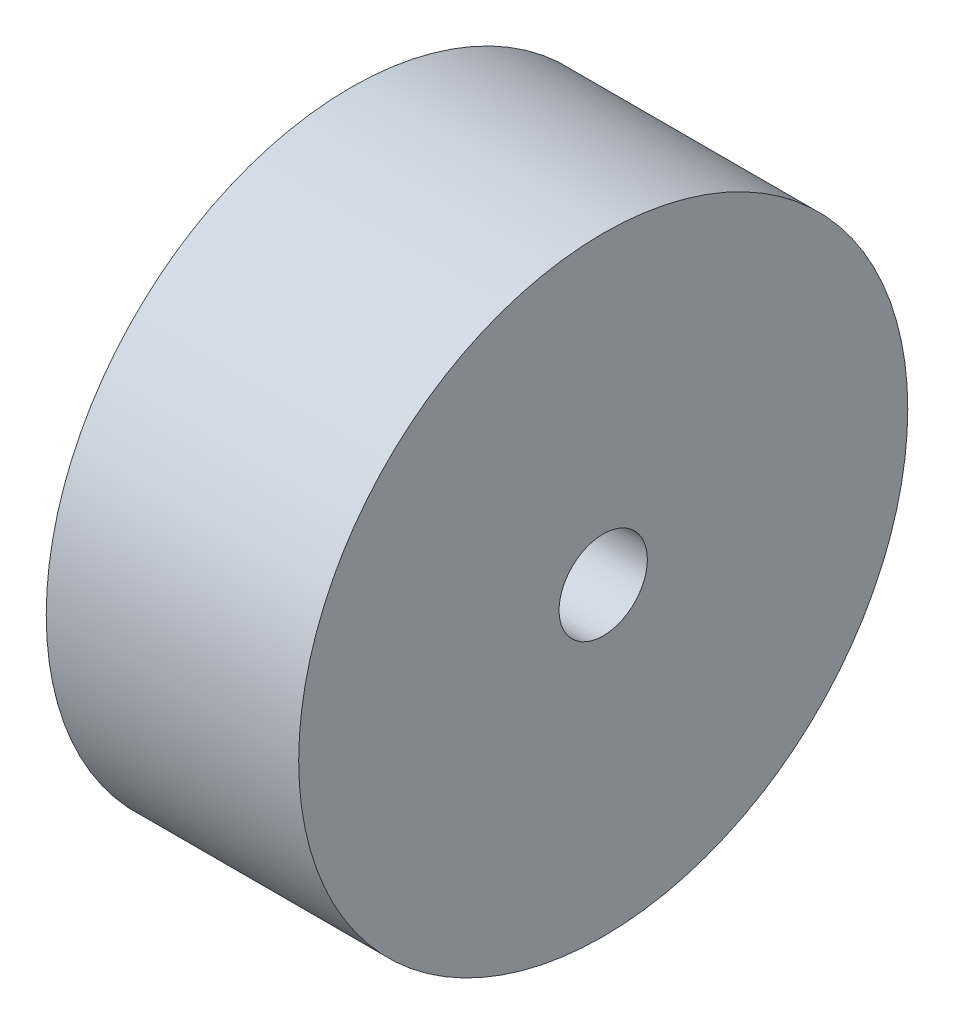
ISO-10303-21;
HEADER;
FILE_DESCRIPTION(('STEP AP214'),'2;1');
FILE_NAME('part.step','',(''),(''),'','','');
FILE_SCHEMA(('AUTOMOTIVE_DESIGN { 1 0 10303 214 1 1 1 1 }'));
ENDSEC;
DATA;
#1=APPLICATION_CONTEXT('core data for automotive mechanical design processes');
#2=APPLICATION_PROTOCOL_DEFINITION('international standard','automotive_design',2000,#1);
#3=PRODUCT_CONTEXT('',#1,'mechanical');
#4=PRODUCT('Part','Part','',(#3));
#5=PRODUCT_RELATED_PRODUCT_CATEGORY('part','',(#4));
#6=PRODUCT_DEFINITION_FORMATION('','',#4);
#7=PRODUCT_DEFINITION_CONTEXT('part definition',#1,'design');
#8=PRODUCT_DEFINITION('design','',#6,#7);
#9=PRODUCT_DEFINITION_SHAPE('','',#8);
#10=(LENGTH_UNIT() NAMED_UNIT(*) SI_UNIT(.MILLI.,.METRE.));
#11=(NAMED_UNIT(*) PLANE_ANGLE_UNIT() SI_UNIT($,.RADIAN.));
#12=(NAMED_UNIT(*) SI_UNIT($,.STERADIAN.) SOLID_ANGLE_UNIT());
#13=UNCERTAINTY_MEASURE_WITH_UNIT(LENGTH_MEASURE(1.E-05),#10,'distance_accuracy_value','');
#14=(GEOMETRIC_REPRESENTATION_CONTEXT(3) GLOBAL_UNCERTAINTY_ASSIGNED_CONTEXT((#13)) GLOBAL_UNIT_ASSIGNED_CONTEXT((#10,
#11,#12)) REPRESENTATION_CONTEXT('',''));
#15=CARTESIAN_POINT('',(0.,0.,0.));
#16=DIRECTION('',(0.,0.,1.));
#17=DIRECTION('',(1.,0.,0.));
#18=AXIS2_PLACEMENT_3D('',#15,#16,#17);
#19=CARTESIAN_POINT('',(14.3,0.,0.));
#20=DIRECTION('',(-1.,0.,0.));
#21=DIRECTION('',(0.,0.,1.));
#22=AXIS2_PLACEMENT_3D('',#19,#20,#21);
#23=CYLINDRICAL_SURFACE('',#22,17.25);
#24=CARTESIAN_POINT('',(14.3,0.,0.));
#25=DIRECTION('',(1.,0.,0.));
#26=DIRECTION('',(0.,0.,-1.));
#27=AXIS2_PLACEMENT_3D('',#24,#25,#26);
#28=CIRCLE('',#27,17.25);
#29=CARTESIAN_POINT('',(14.3,0.,-17.25));
#30=VERTEX_POINT('',#29);
#31=EDGE_CURVE('E10',#30,#30,#28,.T.);
#32=ORIENTED_EDGE('',*,*,#31,.F.);
#33=EDGE_LOOP('',(#32));
#34=FACE_BOUND('',#33,.T.);
#35=CARTESIAN_POINT('',(0.,0.,0.));
#36=DIRECTION('',(1.,0.,0.));
#37=DIRECTION('',(0.,0.,-1.));
#38=AXIS2_PLACEMENT_3D('',#35,#36,#37);
#39=CIRCLE('',#38,17.25);
#40=CARTESIAN_POINT('',(0.,0.,-17.25));
#41=VERTEX_POINT('',#40);
#42=EDGE_CURVE('E34',#41,#41,#39,.T.);
#43=ORIENTED_EDGE('',*,*,#42,.T.);
#44=EDGE_LOOP('',(#43));
#45=FACE_BOUND('',#44,.T.);
#46=ADVANCED_FACE('F31',(#34,#45),#23,.T.);
#47=CARTESIAN_POINT('',(14.3,0.,0.));
#48=DIRECTION('',(1.,0.,0.));
#49=DIRECTION('',(0.,0.,-1.));
#50=AXIS2_PLACEMENT_3D('',#47,#48,#49);
#51=PLANE('',#50);
#52=CARTESIAN_POINT('',(14.3,0.,0.));
#53=DIRECTION('',(1.,0.,0.));
#54=DIRECTION('',(0.,0.,-1.));
#55=AXIS2_PLACEMENT_3D('',#52,#53,#54);
#56=CIRCLE('',#55,2.5);
#57=CARTESIAN_POINT('',(14.3,0.,-2.5));
#58=VERTEX_POINT('',#57);
#59=EDGE_CURVE('E41',#58,#58,#56,.T.);
#60=ORIENTED_EDGE('',*,*,#59,.F.);
#61=EDGE_LOOP('',(#60));
#62=FACE_BOUND('',#61,.T.);
#63=ORIENTED_EDGE('',*,*,#31,.T.);
#64=EDGE_LOOP('',(#63));
#65=FACE_BOUND('',#64,.T.);
#66=ADVANCED_FACE('F60',(#62,#65),#51,.T.);
#67=CARTESIAN_POINT('',(0.,0.,0.));
#68=DIRECTION('',(1.,0.,0.));
#69=DIRECTION('',(0.,0.,-1.));
#70=AXIS2_PLACEMENT_3D('',#67,#68,#69);
#71=PLANE('',#70);
#72=CARTESIAN_POINT('',(0.,0.,0.));
#73=DIRECTION('',(1.,0.,0.));
#74=DIRECTION('',(0.,0.,-1.));
#75=AXIS2_PLACEMENT_3D('',#72,#73,#74);
#76=CIRCLE('',#75,2.5);
#77=CARTESIAN_POINT('',(0.,0.,-2.5));
#78=VERTEX_POINT('',#77);
#79=EDGE_CURVE('E45',#78,#78,#76,.T.);
#80=ORIENTED_EDGE('',*,*,#79,.T.);
#81=EDGE_LOOP('',(#80));
#82=FACE_BOUND('',#81,.T.);
#83=ORIENTED_EDGE('',*,*,#42,.F.);
#84=EDGE_LOOP('',(#83));
#85=FACE_BOUND('',#84,.T.);
#86=ADVANCED_FACE('F49',(#82,#85),#71,.F.);
#87=CARTESIAN_POINT('',(0.,0.,0.));
#88=DIRECTION('',(1.,0.,0.));
#89=DIRECTION('',(0.,0.,-1.));
#90=AXIS2_PLACEMENT_3D('',#87,#88,#89);
#91=CYLINDRICAL_SURFACE('',#90,2.5);
#92=ORIENTED_EDGE('',*,*,#59,.T.);
#93=EDGE_LOOP('',(#92));
#94=FACE_BOUND('',#93,.T.);
#95=ORIENTED_EDGE('',*,*,#79,.F.);
#96=EDGE_LOOP('',(#95));
#97=FACE_BOUND('',#96,.T.);
#98=ADVANCED_FACE('F52',(#94,#97),#91,.F.);
#99=CLOSED_SHELL('',(#46,#66,#86,#98));
#100=MANIFOLD_SOLID_BREP('B2',#99);
#101=ADVANCED_BREP_SHAPE_REPRESENTATION('',(#18,#100),#14);
#102=SHAPE_DEFINITION_REPRESENTATION(#9,#101);
ENDSEC;
END-ISO-10303-21;
